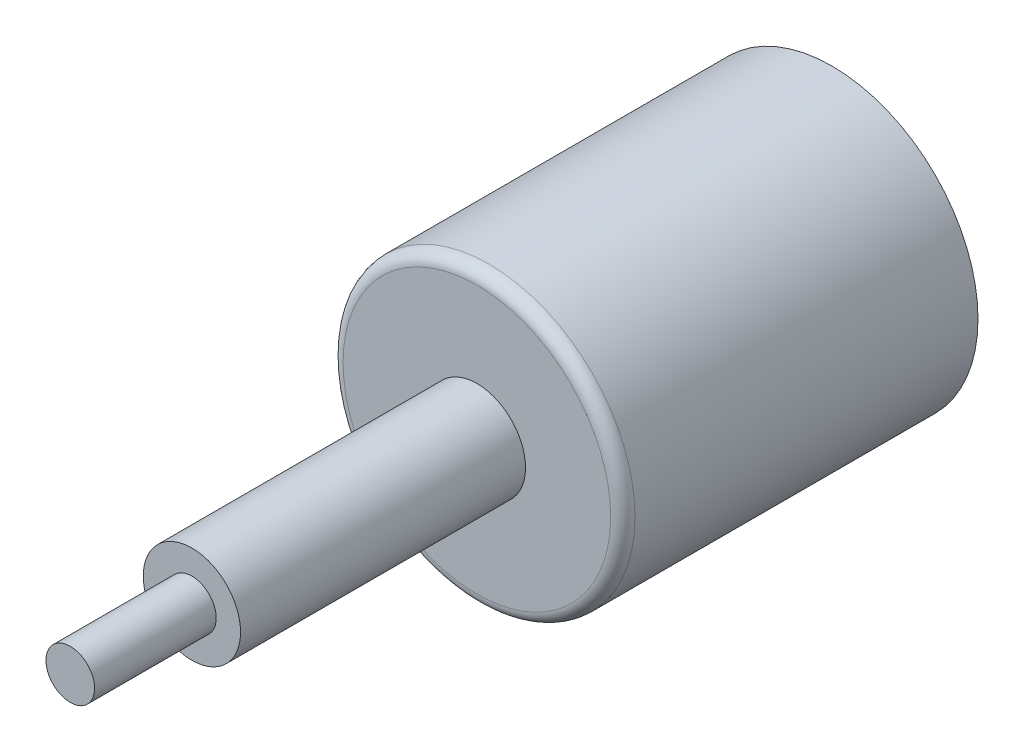
ISO-10303-21;
HEADER;
FILE_DESCRIPTION(('STEP AP214'),'2;1');
FILE_NAME('part.step','',(''),(''),'','','');
FILE_SCHEMA(('AUTOMOTIVE_DESIGN { 1 0 10303 214 1 1 1 1 }'));
ENDSEC;
DATA;
#1=APPLICATION_CONTEXT('core data for automotive mechanical design processes');
#2=APPLICATION_PROTOCOL_DEFINITION('international standard','automotive_design',2000,#1);
#3=PRODUCT_CONTEXT('',#1,'mechanical');
#4=PRODUCT('Part','Part','',(#3));
#5=PRODUCT_RELATED_PRODUCT_CATEGORY('part','',(#4));
#6=PRODUCT_DEFINITION_FORMATION('','',#4);
#7=PRODUCT_DEFINITION_CONTEXT('part definition',#1,'design');
#8=PRODUCT_DEFINITION('design','',#6,#7);
#9=PRODUCT_DEFINITION_SHAPE('','',#8);
#10=(LENGTH_UNIT() NAMED_UNIT(*) SI_UNIT(.MILLI.,.METRE.));
#11=(NAMED_UNIT(*) PLANE_ANGLE_UNIT() SI_UNIT($,.RADIAN.));
#12=(NAMED_UNIT(*) SI_UNIT($,.STERADIAN.) SOLID_ANGLE_UNIT());
#13=UNCERTAINTY_MEASURE_WITH_UNIT(LENGTH_MEASURE(1.E-05),#10,'distance_accuracy_value','');
#14=(GEOMETRIC_REPRESENTATION_CONTEXT(3) GLOBAL_UNCERTAINTY_ASSIGNED_CONTEXT((#13)) GLOBAL_UNIT_ASSIGNED_CONTEXT((#10,
#11,#12)) REPRESENTATION_CONTEXT('',''));
#15=CARTESIAN_POINT('',(0.,0.,0.));
#16=DIRECTION('',(0.,0.,1.));
#17=DIRECTION('',(1.,0.,0.));
#18=AXIS2_PLACEMENT_3D('',#15,#16,#17);
#19=CARTESIAN_POINT('',(0.,0.,52.63));
#20=DIRECTION('',(0.,0.,1.));
#21=DIRECTION('',(1.,0.,0.));
#22=AXIS2_PLACEMENT_3D('',#19,#20,#21);
#23=PLANE('',#22);
#24=CARTESIAN_POINT('',(0.,0.,52.63));
#25=DIRECTION('',(0.,0.,1.));
#26=DIRECTION('',(1.,0.,0.));
#27=AXIS2_PLACEMENT_3D('',#24,#25,#26);
#28=CIRCLE('',#27,4.);
#29=CARTESIAN_POINT('',(4.,0.,52.63));
#30=VERTEX_POINT('',#29);
#31=EDGE_CURVE('E45',#30,#30,#28,.T.);
#32=ORIENTED_EDGE('',*,*,#31,.T.);
#33=EDGE_LOOP('',(#32));
#34=FACE_BOUND('',#33,.T.);
#35=CARTESIAN_POINT('',(0.,0.,52.63));
#36=DIRECTION('',(0.,0.,1.));
#37=DIRECTION('',(1.,0.,0.));
#38=AXIS2_PLACEMENT_3D('',#35,#36,#37);
#39=CIRCLE('',#38,2.);
#40=CARTESIAN_POINT('',(2.,0.,52.63));
#41=VERTEX_POINT('',#40);
#42=EDGE_CURVE('E56',#41,#41,#39,.T.);
#43=ORIENTED_EDGE('',*,*,#42,.F.);
#44=EDGE_LOOP('',(#43));
#45=FACE_BOUND('',#44,.T.);
#46=ADVANCED_FACE('F30',(#34,#45),#23,.T.);
#47=CARTESIAN_POINT('',(0.,0.,29.2));
#48=DIRECTION('',(0.,0.,1.));
#49=DIRECTION('',(1.,0.,0.));
#50=AXIS2_PLACEMENT_3D('',#47,#48,#49);
#51=PLANE('',#50);
#52=CARTESIAN_POINT('',(0.,0.,29.2));
#53=DIRECTION('',(0.,0.,1.));
#54=DIRECTION('',(1.,0.,0.));
#55=AXIS2_PLACEMENT_3D('',#52,#53,#54);
#56=CIRCLE('',#55,11.);
#57=CARTESIAN_POINT('',(11.,0.,29.2));
#58=VERTEX_POINT('',#57);
#59=EDGE_CURVE('E37',#58,#58,#56,.T.);
#60=ORIENTED_EDGE('',*,*,#59,.T.);
#61=EDGE_LOOP('',(#60));
#62=FACE_BOUND('',#61,.T.);
#63=CARTESIAN_POINT('',(0.,0.,29.2));
#64=DIRECTION('',(0.,0.,1.));
#65=DIRECTION('',(1.,0.,0.));
#66=AXIS2_PLACEMENT_3D('',#63,#64,#65);
#67=CIRCLE('',#66,4.);
#68=CARTESIAN_POINT('',(4.,0.,29.2));
#69=VERTEX_POINT('',#68);
#70=EDGE_CURVE('E50',#69,#69,#67,.T.);
#71=ORIENTED_EDGE('',*,*,#70,.F.);
#72=EDGE_LOOP('',(#71));
#73=FACE_BOUND('',#72,.T.);
#74=ADVANCED_FACE('F63',(#62,#73),#51,.T.);
#75=CARTESIAN_POINT('',(0.,0.,29.2));
#76=DIRECTION('',(0.,0.,-1.));
#77=DIRECTION('',(-1.,0.,0.));
#78=AXIS2_PLACEMENT_3D('',#75,#76,#77);
#79=CYLINDRICAL_SURFACE('',#78,12.);
#80=CARTESIAN_POINT('',(0.,0.,28.2));
#81=DIRECTION('',(0.,0.,1.));
#82=DIRECTION('',(1.,0.,0.));
#83=AXIS2_PLACEMENT_3D('',#80,#81,#82);
#84=CIRCLE('',#83,12.);
#85=CARTESIAN_POINT('',(12.,0.,28.2));
#86=VERTEX_POINT('',#85);
#87=EDGE_CURVE('E10',#86,#86,#84,.F.);
#88=ORIENTED_EDGE('',*,*,#87,.T.);
#89=EDGE_LOOP('',(#88));
#90=FACE_BOUND('',#89,.T.);
#91=CARTESIAN_POINT('',(0.,0.,0.));
#92=DIRECTION('',(0.,0.,1.));
#93=DIRECTION('',(1.,0.,0.));
#94=AXIS2_PLACEMENT_3D('',#91,#92,#93);
#95=CIRCLE('',#94,12.);
#96=CARTESIAN_POINT('',(12.,0.,0.));
#97=VERTEX_POINT('',#96);
#98=EDGE_CURVE('E41',#97,#97,#95,.T.);
#99=ORIENTED_EDGE('',*,*,#98,.T.);
#100=EDGE_LOOP('',(#99));
#101=FACE_BOUND('',#100,.T.);
#102=ADVANCED_FACE('F32',(#90,#101),#79,.T.);
#103=CARTESIAN_POINT('',(0.,0.,0.));
#104=DIRECTION('',(0.,0.,1.));
#105=DIRECTION('',(1.,0.,0.));
#106=AXIS2_PLACEMENT_3D('',#103,#104,#105);
#107=PLANE('',#106);
#108=ORIENTED_EDGE('',*,*,#98,.F.);
#109=EDGE_LOOP('',(#108));
#110=FACE_BOUND('',#109,.T.);
#111=ADVANCED_FACE('F79',(#110),#107,.F.);
#112=CARTESIAN_POINT('',(0.,0.,28.2));
#113=DIRECTION('',(0.,0.,1.));
#114=DIRECTION('',(1.,0.,0.));
#115=AXIS2_PLACEMENT_3D('',#112,#113,#114);
#116=TOROIDAL_SURFACE('',#115,11.,1.);
#117=ORIENTED_EDGE('',*,*,#87,.F.);
#118=EDGE_LOOP('',(#117));
#119=FACE_BOUND('',#118,.T.);
#120=ORIENTED_EDGE('',*,*,#59,.F.);
#121=EDGE_LOOP('',(#120));
#122=FACE_BOUND('',#121,.T.);
#123=ADVANCED_FACE('F75',(#119,#122),#116,.T.);
#124=CARTESIAN_POINT('',(0.,0.,52.63));
#125=DIRECTION('',(0.,0.,-1.));
#126=DIRECTION('',(-1.,0.,0.));
#127=AXIS2_PLACEMENT_3D('',#124,#125,#126);
#128=CYLINDRICAL_SURFACE('',#127,4.);
#129=ORIENTED_EDGE('',*,*,#31,.F.);
#130=EDGE_LOOP('',(#129));
#131=FACE_BOUND('',#130,.T.);
#132=ORIENTED_EDGE('',*,*,#70,.T.);
#133=EDGE_LOOP('',(#132));
#134=FACE_BOUND('',#133,.T.);
#135=ADVANCED_FACE('F72',(#131,#134),#128,.T.);
#136=CARTESIAN_POINT('',(0.,0.,62.63));
#137=DIRECTION('',(0.,0.,-1.));
#138=DIRECTION('',(-1.,0.,0.));
#139=AXIS2_PLACEMENT_3D('',#136,#137,#138);
#140=CYLINDRICAL_SURFACE('',#139,2.);
#141=CARTESIAN_POINT('',(0.,0.,62.63));
#142=DIRECTION('',(0.,0.,1.));
#143=DIRECTION('',(1.,0.,0.));
#144=AXIS2_PLACEMENT_3D('',#141,#142,#143);
#145=CIRCLE('',#144,2.);
#146=CARTESIAN_POINT('',(2.,0.,62.63));
#147=VERTEX_POINT('',#146);
#148=EDGE_CURVE('E53',#147,#147,#145,.T.);
#149=ORIENTED_EDGE('',*,*,#148,.F.);
#150=EDGE_LOOP('',(#149));
#151=FACE_BOUND('',#150,.T.);
#152=ORIENTED_EDGE('',*,*,#42,.T.);
#153=EDGE_LOOP('',(#152));
#154=FACE_BOUND('',#153,.T.);
#155=ADVANCED_FACE('F60',(#151,#154),#140,.T.);
#156=CARTESIAN_POINT('',(0.,0.,62.63));
#157=DIRECTION('',(0.,0.,1.));
#158=DIRECTION('',(1.,0.,0.));
#159=AXIS2_PLACEMENT_3D('',#156,#157,#158);
#160=PLANE('',#159);
#161=ORIENTED_EDGE('',*,*,#148,.T.);
#162=EDGE_LOOP('',(#161));
#163=FACE_BOUND('',#162,.T.);
#164=ADVANCED_FACE('F116',(#163),#160,.T.);
#165=CLOSED_SHELL('',(#46,#74,#102,#111,#123,#135,#155,#164));
#166=MANIFOLD_SOLID_BREP('B2',#165);
#167=ADVANCED_BREP_SHAPE_REPRESENTATION('',(#18,#166),#14);
#168=SHAPE_DEFINITION_REPRESENTATION(#9,#167);
ENDSEC;
END-ISO-10303-21;
